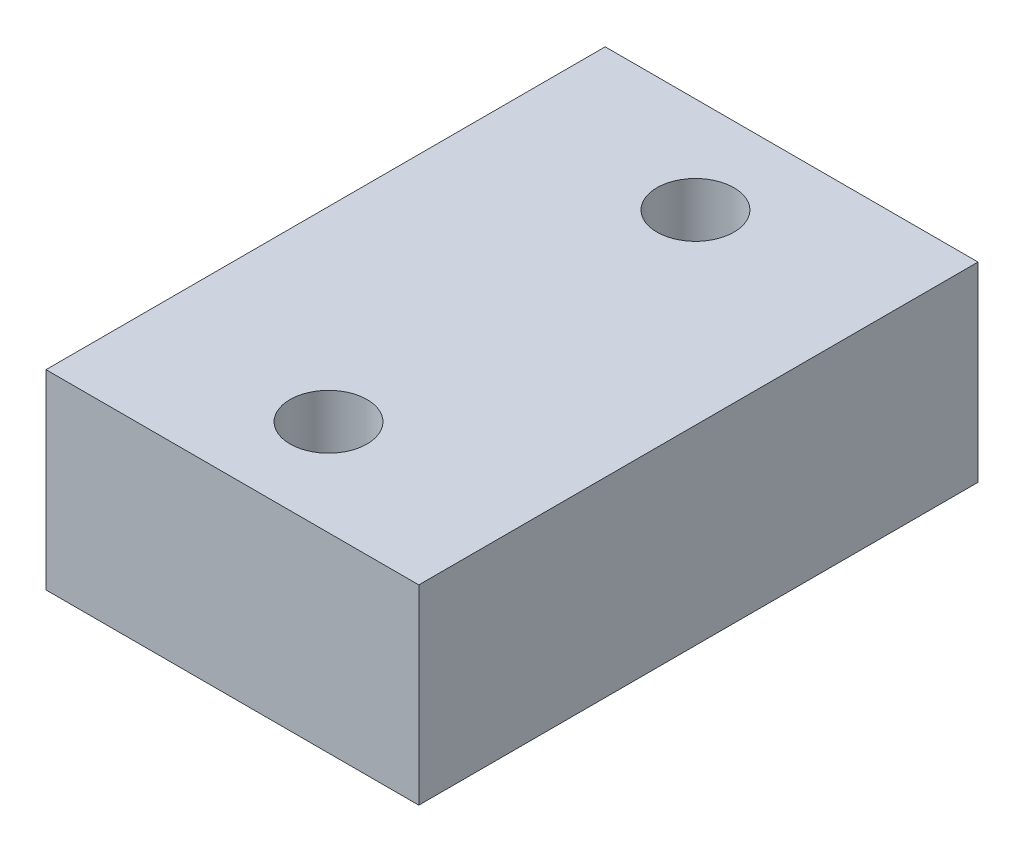
ISO-10303-21;
HEADER;
FILE_DESCRIPTION(('STEP AP214'),'2;1');
FILE_NAME('part.step','',(''),(''),'','','');
FILE_SCHEMA(('AUTOMOTIVE_DESIGN { 1 0 10303 214 1 1 1 1 }'));
ENDSEC;
DATA;
#1=APPLICATION_CONTEXT('core data for automotive mechanical design processes');
#2=APPLICATION_PROTOCOL_DEFINITION('international standard','automotive_design',2000,#1);
#3=PRODUCT_CONTEXT('',#1,'mechanical');
#4=PRODUCT('Part','Part','',(#3));
#5=PRODUCT_RELATED_PRODUCT_CATEGORY('part','',(#4));
#6=PRODUCT_DEFINITION_FORMATION('','',#4);
#7=PRODUCT_DEFINITION_CONTEXT('part definition',#1,'design');
#8=PRODUCT_DEFINITION('design','',#6,#7);
#9=PRODUCT_DEFINITION_SHAPE('','',#8);
#10=(LENGTH_UNIT() NAMED_UNIT(*) SI_UNIT(.MILLI.,.METRE.));
#11=(NAMED_UNIT(*) PLANE_ANGLE_UNIT() SI_UNIT($,.RADIAN.));
#12=(NAMED_UNIT(*) SI_UNIT($,.STERADIAN.) SOLID_ANGLE_UNIT());
#13=UNCERTAINTY_MEASURE_WITH_UNIT(LENGTH_MEASURE(1.E-05),#10,'distance_accuracy_value','');
#14=(GEOMETRIC_REPRESENTATION_CONTEXT(3) GLOBAL_UNCERTAINTY_ASSIGNED_CONTEXT((#13)) GLOBAL_UNIT_ASSIGNED_CONTEXT((#10,
#11,#12)) REPRESENTATION_CONTEXT('',''));
#15=CARTESIAN_POINT('',(0.,0.,0.));
#16=DIRECTION('',(0.,0.,1.));
#17=DIRECTION('',(1.,0.,0.));
#18=AXIS2_PLACEMENT_3D('',#15,#16,#17);
#19=CARTESIAN_POINT('',(25.4,26.,38.1));
#20=DIRECTION('',(-1.,0.,0.));
#21=DIRECTION('',(0.,0.,1.));
#22=AXIS2_PLACEMENT_3D('',#19,#20,#21);
#23=PLANE('',#22);
#24=DIRECTION('',(0.,0.,-1.));
#25=VECTOR('',#24,1.);
#26=CARTESIAN_POINT('',(25.4,0.,38.1));
#27=LINE('',#26,#25);
#28=CARTESIAN_POINT('',(25.4,0.,38.1));
#29=VERTEX_POINT('',#28);
#30=CARTESIAN_POINT('',(25.4,0.,-38.1));
#31=VERTEX_POINT('',#30);
#32=EDGE_CURVE('E94',#29,#31,#27,.T.);
#33=ORIENTED_EDGE('',*,*,#32,.T.);
#34=DIRECTION('',(0.,-1.,0.));
#35=VECTOR('',#34,1.);
#36=CARTESIAN_POINT('',(25.4,26.,-38.1));
#37=LINE('',#36,#35);
#38=CARTESIAN_POINT('',(25.4,26.,-38.1));
#39=VERTEX_POINT('',#38);
#40=EDGE_CURVE('E11',#39,#31,#37,.T.);
#41=ORIENTED_EDGE('',*,*,#40,.F.);
#42=DIRECTION('',(0.,0.,-1.));
#43=VECTOR('',#42,1.);
#44=CARTESIAN_POINT('',(25.4,26.,38.1));
#45=LINE('',#44,#43);
#46=CARTESIAN_POINT('',(25.4,26.,38.1));
#47=VERTEX_POINT('',#46);
#48=EDGE_CURVE('E82',#47,#39,#45,.T.);
#49=ORIENTED_EDGE('',*,*,#48,.F.);
#50=DIRECTION('',(0.,-1.,0.));
#51=VECTOR('',#50,1.);
#52=CARTESIAN_POINT('',(25.4,26.,38.1));
#53=LINE('',#52,#51);
#54=EDGE_CURVE('E90',#47,#29,#53,.T.);
#55=ORIENTED_EDGE('',*,*,#54,.T.);
#56=EDGE_LOOP('',(#33,#41,#49,#55));
#57=FACE_BOUND('',#56,.T.);
#58=ADVANCED_FACE('F31',(#57),#23,.F.);
#59=CARTESIAN_POINT('',(-25.4,26.,-38.1));
#60=DIRECTION('',(0.,0.,1.));
#61=DIRECTION('',(1.,0.,0.));
#62=AXIS2_PLACEMENT_3D('',#59,#60,#61);
#63=PLANE('',#62);
#64=DIRECTION('',(-1.,0.,0.));
#65=VECTOR('',#64,1.);
#66=CARTESIAN_POINT('',(-25.4,0.,-38.1));
#67=LINE('',#66,#65);
#68=CARTESIAN_POINT('',(-25.4,0.,-38.1));
#69=VERTEX_POINT('',#68);
#70=EDGE_CURVE('E86',#31,#69,#67,.T.);
#71=ORIENTED_EDGE('',*,*,#70,.T.);
#72=DIRECTION('',(0.,-1.,0.));
#73=VECTOR('',#72,1.);
#74=CARTESIAN_POINT('',(-25.4,26.,-38.1));
#75=LINE('',#74,#73);
#76=CARTESIAN_POINT('',(-25.4,26.,-38.1));
#77=VERTEX_POINT('',#76);
#78=EDGE_CURVE('E39',#77,#69,#75,.T.);
#79=ORIENTED_EDGE('',*,*,#78,.F.);
#80=DIRECTION('',(-1.,0.,0.));
#81=VECTOR('',#80,1.);
#82=CARTESIAN_POINT('',(-25.4,26.,-38.1));
#83=LINE('',#82,#81);
#84=EDGE_CURVE('E77',#39,#77,#83,.T.);
#85=ORIENTED_EDGE('',*,*,#84,.F.);
#86=ORIENTED_EDGE('',*,*,#40,.T.);
#87=EDGE_LOOP('',(#71,#79,#85,#86));
#88=FACE_BOUND('',#87,.T.);
#89=ADVANCED_FACE('F85',(#88),#63,.F.);
#90=CARTESIAN_POINT('',(-25.4,26.,38.1));
#91=DIRECTION('',(1.,0.,0.));
#92=DIRECTION('',(0.,0.,-1.));
#93=AXIS2_PLACEMENT_3D('',#90,#91,#92);
#94=PLANE('',#93);
#95=DIRECTION('',(0.,0.,1.));
#96=VECTOR('',#95,1.);
#97=CARTESIAN_POINT('',(-25.4,0.,38.1));
#98=LINE('',#97,#96);
#99=CARTESIAN_POINT('',(-25.4,0.,38.1));
#100=VERTEX_POINT('',#99);
#101=EDGE_CURVE('E64',#69,#100,#98,.T.);
#102=ORIENTED_EDGE('',*,*,#101,.T.);
#103=DIRECTION('',(0.,-1.,0.));
#104=VECTOR('',#103,1.);
#105=CARTESIAN_POINT('',(-25.4,26.,38.1));
#106=LINE('',#105,#104);
#107=CARTESIAN_POINT('',(-25.4,26.,38.1));
#108=VERTEX_POINT('',#107);
#109=EDGE_CURVE('E87',#108,#100,#106,.T.);
#110=ORIENTED_EDGE('',*,*,#109,.F.);
#111=DIRECTION('',(0.,0.,1.));
#112=VECTOR('',#111,1.);
#113=CARTESIAN_POINT('',(-25.4,26.,38.1));
#114=LINE('',#113,#112);
#115=EDGE_CURVE('E80',#77,#108,#114,.T.);
#116=ORIENTED_EDGE('',*,*,#115,.F.);
#117=ORIENTED_EDGE('',*,*,#78,.T.);
#118=EDGE_LOOP('',(#102,#110,#116,#117));
#119=FACE_BOUND('',#118,.T.);
#120=ADVANCED_FACE('F88',(#119),#94,.F.);
#121=CARTESIAN_POINT('',(-25.4,26.,38.1));
#122=DIRECTION('',(0.,0.,-1.));
#123=DIRECTION('',(-1.,0.,0.));
#124=AXIS2_PLACEMENT_3D('',#121,#122,#123);
#125=PLANE('',#124);
#126=DIRECTION('',(1.,0.,0.));
#127=VECTOR('',#126,1.);
#128=CARTESIAN_POINT('',(-25.4,0.,38.1));
#129=LINE('',#128,#127);
#130=EDGE_CURVE('E70',#100,#29,#129,.T.);
#131=ORIENTED_EDGE('',*,*,#130,.T.);
#132=ORIENTED_EDGE('',*,*,#54,.F.);
#133=DIRECTION('',(1.,0.,0.));
#134=VECTOR('',#133,1.);
#135=CARTESIAN_POINT('',(-25.4,26.,38.1));
#136=LINE('',#135,#134);
#137=EDGE_CURVE('E47',#108,#47,#136,.T.);
#138=ORIENTED_EDGE('',*,*,#137,.F.);
#139=ORIENTED_EDGE('',*,*,#109,.T.);
#140=EDGE_LOOP('',(#131,#132,#138,#139));
#141=FACE_BOUND('',#140,.T.);
#142=ADVANCED_FACE('F102',(#141),#125,.F.);
#143=CARTESIAN_POINT('',(25.4,26.,-38.1));
#144=DIRECTION('',(0.,-1.,0.));
#145=DIRECTION('',(0.,0.,-1.));
#146=AXIS2_PLACEMENT_3D('',#143,#144,#145);
#147=PLANE('',#146);
#148=CARTESIAN_POINT('',(0.,26.,25.));
#149=DIRECTION('',(0.,1.,0.));
#150=DIRECTION('',(0.,0.,1.));
#151=AXIS2_PLACEMENT_3D('',#148,#149,#150);
#152=CIRCLE('',#151,5.25);
#153=CARTESIAN_POINT('',(0.,26.,30.25));
#154=VERTEX_POINT('',#153);
#155=EDGE_CURVE('E111',#154,#154,#152,.T.);
#156=ORIENTED_EDGE('',*,*,#155,.F.);
#157=EDGE_LOOP('',(#156));
#158=FACE_BOUND('',#157,.T.);
#159=CARTESIAN_POINT('',(0.,26.,-25.));
#160=DIRECTION('',(0.,1.,0.));
#161=DIRECTION('',(0.,0.,1.));
#162=AXIS2_PLACEMENT_3D('',#159,#160,#161);
#163=CIRCLE('',#162,5.25);
#164=CARTESIAN_POINT('',(0.,26.,-19.75));
#165=VERTEX_POINT('',#164);
#166=EDGE_CURVE('E108',#165,#165,#163,.T.);
#167=ORIENTED_EDGE('',*,*,#166,.F.);
#168=EDGE_LOOP('',(#167));
#169=FACE_BOUND('',#168,.T.);
#170=ORIENTED_EDGE('',*,*,#48,.T.);
#171=ORIENTED_EDGE('',*,*,#84,.T.);
#172=ORIENTED_EDGE('',*,*,#115,.T.);
#173=ORIENTED_EDGE('',*,*,#137,.T.);
#174=EDGE_LOOP('',(#170,#171,#172,#173));
#175=FACE_BOUND('',#174,.T.);
#176=ADVANCED_FACE('F78',(#158,#169,#175),#147,.F.);
#177=CARTESIAN_POINT('',(25.4,0.,-38.1));
#178=DIRECTION('',(0.,-1.,0.));
#179=DIRECTION('',(0.,0.,-1.));
#180=AXIS2_PLACEMENT_3D('',#177,#178,#179);
#181=PLANE('',#180);
#182=CARTESIAN_POINT('',(0.,0.,25.));
#183=DIRECTION('',(0.,1.,0.));
#184=DIRECTION('',(0.,0.,1.));
#185=AXIS2_PLACEMENT_3D('',#182,#183,#184);
#186=CIRCLE('',#185,5.25);
#187=CARTESIAN_POINT('',(0.,0.,30.25));
#188=VERTEX_POINT('',#187);
#189=EDGE_CURVE('E114',#188,#188,#186,.T.);
#190=ORIENTED_EDGE('',*,*,#189,.T.);
#191=EDGE_LOOP('',(#190));
#192=FACE_BOUND('',#191,.T.);
#193=CARTESIAN_POINT('',(0.,0.,-25.));
#194=DIRECTION('',(0.,1.,0.));
#195=DIRECTION('',(0.,0.,1.));
#196=AXIS2_PLACEMENT_3D('',#193,#194,#195);
#197=CIRCLE('',#196,5.25);
#198=CARTESIAN_POINT('',(0.,0.,-19.75));
#199=VERTEX_POINT('',#198);
#200=EDGE_CURVE('E97',#199,#199,#197,.T.);
#201=ORIENTED_EDGE('',*,*,#200,.T.);
#202=EDGE_LOOP('',(#201));
#203=FACE_BOUND('',#202,.T.);
#204=ORIENTED_EDGE('',*,*,#32,.F.);
#205=ORIENTED_EDGE('',*,*,#130,.F.);
#206=ORIENTED_EDGE('',*,*,#101,.F.);
#207=ORIENTED_EDGE('',*,*,#70,.F.);
#208=EDGE_LOOP('',(#204,#205,#206,#207));
#209=FACE_BOUND('',#208,.T.);
#210=ADVANCED_FACE('F105',(#192,#203,#209),#181,.T.);
#211=CARTESIAN_POINT('',(0.,0.,-25.));
#212=DIRECTION('',(0.,1.,0.));
#213=DIRECTION('',(0.,0.,1.));
#214=AXIS2_PLACEMENT_3D('',#211,#212,#213);
#215=CYLINDRICAL_SURFACE('',#214,5.25);
#216=ORIENTED_EDGE('',*,*,#200,.F.);
#217=EDGE_LOOP('',(#216));
#218=FACE_BOUND('',#217,.T.);
#219=ORIENTED_EDGE('',*,*,#166,.T.);
#220=EDGE_LOOP('',(#219));
#221=FACE_BOUND('',#220,.T.);
#222=ADVANCED_FACE('F127',(#218,#221),#215,.F.);
#223=CARTESIAN_POINT('',(0.,0.,25.));
#224=DIRECTION('',(0.,1.,0.));
#225=DIRECTION('',(0.,0.,1.));
#226=AXIS2_PLACEMENT_3D('',#223,#224,#225);
#227=CYLINDRICAL_SURFACE('',#226,5.25);
#228=ORIENTED_EDGE('',*,*,#189,.F.);
#229=EDGE_LOOP('',(#228));
#230=FACE_BOUND('',#229,.T.);
#231=ORIENTED_EDGE('',*,*,#155,.T.);
#232=EDGE_LOOP('',(#231));
#233=FACE_BOUND('',#232,.T.);
#234=ADVANCED_FACE('F120',(#230,#233),#227,.F.);
#235=CLOSED_SHELL('',(#58,#89,#120,#142,#176,#210,#222,#234));
#236=MANIFOLD_SOLID_BREP('B2',#235);
#237=ADVANCED_BREP_SHAPE_REPRESENTATION('',(#18,#236),#14);
#238=SHAPE_DEFINITION_REPRESENTATION(#9,#237);
ENDSEC;
END-ISO-10303-21;
